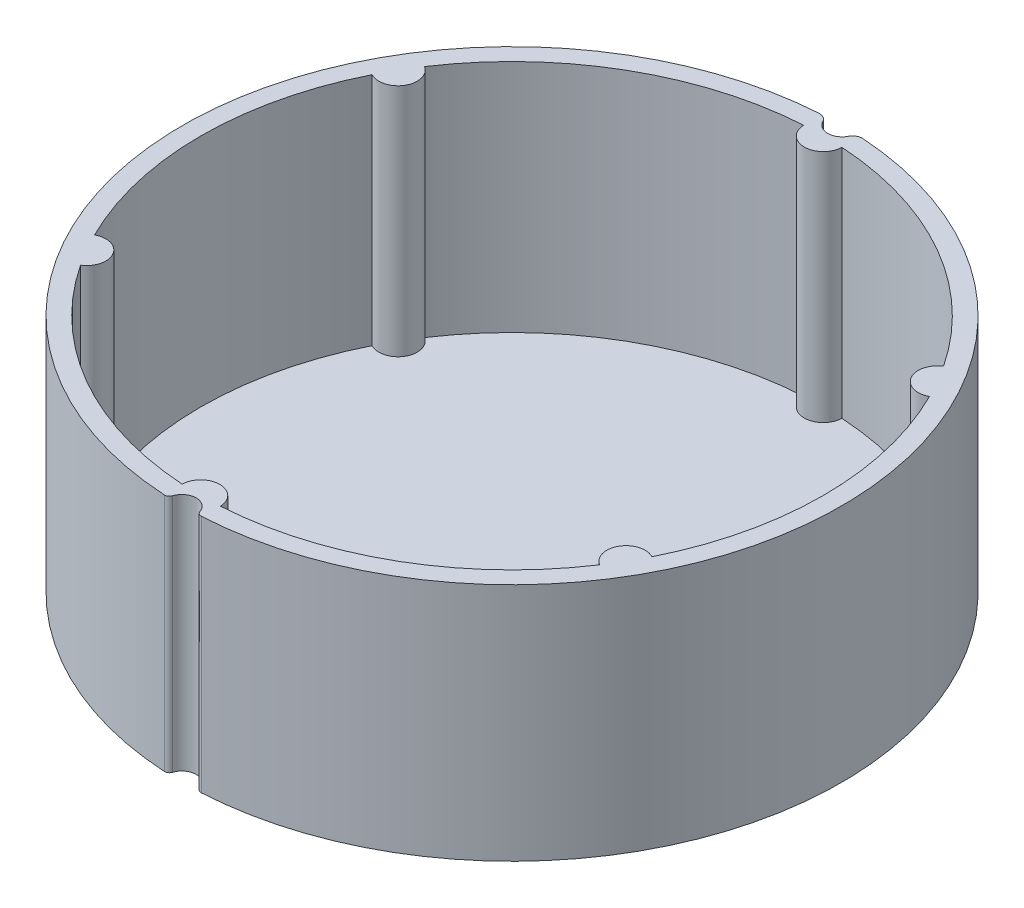
ISO-10303-21;
HEADER;
FILE_DESCRIPTION(('STEP AP214'),'2;1');
FILE_NAME('part.step','',(''),(''),'','','');
FILE_SCHEMA(('AUTOMOTIVE_DESIGN { 1 0 10303 214 1 1 1 1 }'));
ENDSEC;
DATA;
#1=APPLICATION_CONTEXT('core data for automotive mechanical design processes');
#2=APPLICATION_PROTOCOL_DEFINITION('international standard','automotive_design',2000,#1);
#3=PRODUCT_CONTEXT('',#1,'mechanical');
#4=PRODUCT('Part','Part','',(#3));
#5=PRODUCT_RELATED_PRODUCT_CATEGORY('part','',(#4));
#6=PRODUCT_DEFINITION_FORMATION('','',#4);
#7=PRODUCT_DEFINITION_CONTEXT('part definition',#1,'design');
#8=PRODUCT_DEFINITION('design','',#6,#7);
#9=PRODUCT_DEFINITION_SHAPE('','',#8);
#10=(LENGTH_UNIT() NAMED_UNIT(*) SI_UNIT(.MILLI.,.METRE.));
#11=(NAMED_UNIT(*) PLANE_ANGLE_UNIT() SI_UNIT($,.RADIAN.));
#12=(NAMED_UNIT(*) SI_UNIT($,.STERADIAN.) SOLID_ANGLE_UNIT());
#13=UNCERTAINTY_MEASURE_WITH_UNIT(LENGTH_MEASURE(1.E-05),#10,'distance_accuracy_value','');
#14=(GEOMETRIC_REPRESENTATION_CONTEXT(3) GLOBAL_UNCERTAINTY_ASSIGNED_CONTEXT((#13)) GLOBAL_UNIT_ASSIGNED_CONTEXT((#10,
#11,#12)) REPRESENTATION_CONTEXT('',''));
#15=CARTESIAN_POINT('',(0.,0.,0.));
#16=DIRECTION('',(0.,0.,1.));
#17=DIRECTION('',(1.,0.,0.));
#18=AXIS2_PLACEMENT_3D('',#15,#16,#17);
#19=CARTESIAN_POINT('',(-1.91626157924767,25.,33.8457965124164));
#20=DIRECTION('',(0.,-1.,0.));
#21=DIRECTION('',(0.,0.,-1.));
#22=AXIS2_PLACEMENT_3D('',#19,#20,#21);
#23=CYLINDRICAL_SURFACE('',#22,0.499999999999997);
#24=CARTESIAN_POINT('',(-1.91626157924767,0.,33.8457965124164));
#25=DIRECTION('',(0.,1.,0.));
#26=DIRECTION('',(0.,0.,1.));
#27=AXIS2_PLACEMENT_3D('',#24,#25,#26);
#28=CIRCLE('',#27,0.499999999999997);
#29=CARTESIAN_POINT('',(-1.43995370754552,0.,33.9978846820897));
#30=VERTEX_POINT('',#29);
#31=CARTESIAN_POINT('',(-1.94452502436932,0.,34.3449970509476));
#32=VERTEX_POINT('',#31);
#33=EDGE_CURVE('E252',#30,#32,#28,.F.);
#34=ORIENTED_EDGE('',*,*,#33,.F.);
#35=DIRECTION('',(0.,-1.,0.));
#36=VECTOR('',#35,1.);
#37=CARTESIAN_POINT('',(-1.43995370754552,25.,33.9978846820897));
#38=LINE('',#37,#36);
#39=CARTESIAN_POINT('',(-1.43995370754552,25.,33.9978846820897));
#40=VERTEX_POINT('',#39);
#41=EDGE_CURVE('E11',#40,#30,#38,.T.);
#42=ORIENTED_EDGE('',*,*,#41,.F.);
#43=CARTESIAN_POINT('',(-1.91626157924767,25.,33.8457965124164));
#44=DIRECTION('',(0.,1.,0.));
#45=DIRECTION('',(0.,0.,1.));
#46=AXIS2_PLACEMENT_3D('',#43,#44,#45);
#47=CIRCLE('',#46,0.499999999999997);
#48=CARTESIAN_POINT('',(-1.94452502436932,25.,34.3449970509476));
#49=VERTEX_POINT('',#48);
#50=EDGE_CURVE('E253',#40,#49,#47,.F.);
#51=ORIENTED_EDGE('',*,*,#50,.T.);
#52=DIRECTION('',(0.,-1.,0.));
#53=VECTOR('',#52,1.);
#54=CARTESIAN_POINT('',(-1.94452502436932,25.,34.3449970509476));
#55=LINE('',#54,#53);
#56=EDGE_CURVE('E274',#49,#32,#55,.T.);
#57=ORIENTED_EDGE('',*,*,#56,.T.);
#58=EDGE_LOOP('',(#34,#42,#51,#57));
#59=FACE_BOUND('',#58,.T.);
#60=ADVANCED_FACE('F37',(#59),#23,.T.);
#61=CARTESIAN_POINT('',(-0.0110300924390449,25.,34.4541491911095));
#62=DIRECTION('',(0.,-1.,0.));
#63=DIRECTION('',(0.,0.,-1.));
#64=AXIS2_PLACEMENT_3D('',#61,#62,#63);
#65=CYLINDRICAL_SURFACE('',#64,1.50000000000002);
#66=CARTESIAN_POINT('',(-0.0110300924390449,0.,34.4541491911095));
#67=DIRECTION('',(0.,1.,0.));
#68=DIRECTION('',(0.,0.,1.));
#69=AXIS2_PLACEMENT_3D('',#66,#67,#68);
#70=CIRCLE('',#69,1.50000000000002);
#71=CARTESIAN_POINT('',(1.41818536522127,0.,33.9987996818478));
#72=VERTEX_POINT('',#71);
#73=EDGE_CURVE('E277',#72,#30,#70,.T.);
#74=ORIENTED_EDGE('',*,*,#73,.F.);
#75=DIRECTION('',(0.,-1.,0.));
#76=VECTOR('',#75,1.);
#77=CARTESIAN_POINT('',(1.41818536522127,25.,33.9987996818478));
#78=LINE('',#77,#76);
#79=CARTESIAN_POINT('',(1.41818536522127,25.,33.9987996818478));
#80=VERTEX_POINT('',#79);
#81=EDGE_CURVE('E44',#80,#72,#78,.T.);
#82=ORIENTED_EDGE('',*,*,#81,.F.);
#83=CARTESIAN_POINT('',(-0.0110300924390449,25.,34.4541491911095));
#84=DIRECTION('',(0.,1.,0.));
#85=DIRECTION('',(0.,0.,1.));
#86=AXIS2_PLACEMENT_3D('',#83,#84,#85);
#87=CIRCLE('',#86,1.50000000000002);
#88=EDGE_CURVE('E256',#80,#40,#87,.T.);
#89=ORIENTED_EDGE('',*,*,#88,.T.);
#90=ORIENTED_EDGE('',*,*,#41,.T.);
#91=EDGE_LOOP('',(#74,#82,#89,#90));
#92=FACE_BOUND('',#91,.T.);
#93=ADVANCED_FACE('F318',(#92),#65,.F.);
#94=CARTESIAN_POINT('',(1.8945905177747,25.,33.8470165120939));
#95=DIRECTION('',(0.,-1.,0.));
#96=DIRECTION('',(0.,0.,-1.));
#97=AXIS2_PLACEMENT_3D('',#94,#95,#96);
#98=CYLINDRICAL_SURFACE('',#97,0.499999999999999);
#99=CARTESIAN_POINT('',(1.8945905177747,0.,33.8470165120939));
#100=DIRECTION('',(0.,1.,0.));
#101=DIRECTION('',(0.,0.,1.));
#102=AXIS2_PLACEMENT_3D('',#99,#100,#101);
#103=CIRCLE('',#102,0.499999999999999);
#104=CARTESIAN_POINT('',(1.92253433072123,0.,34.3462350447207));
#105=VERTEX_POINT('',#104);
#106=EDGE_CURVE('E280',#72,#105,#103,.T.);
#107=ORIENTED_EDGE('',*,*,#106,.T.);
#108=DIRECTION('',(0.,-1.,0.));
#109=VECTOR('',#108,1.);
#110=CARTESIAN_POINT('',(1.92253433072123,25.,34.3462350447207));
#111=LINE('',#110,#109);
#112=CARTESIAN_POINT('',(1.92253433072123,25.,34.3462350447207));
#113=VERTEX_POINT('',#112);
#114=EDGE_CURVE('E305',#113,#105,#111,.T.);
#115=ORIENTED_EDGE('',*,*,#114,.F.);
#116=CARTESIAN_POINT('',(1.8945905177747,25.,33.8470165120939));
#117=DIRECTION('',(0.,1.,0.));
#118=DIRECTION('',(0.,0.,1.));
#119=AXIS2_PLACEMENT_3D('',#116,#117,#118);
#120=CIRCLE('',#119,0.499999999999999);
#121=EDGE_CURVE('E260',#80,#113,#120,.T.);
#122=ORIENTED_EDGE('',*,*,#121,.F.);
#123=ORIENTED_EDGE('',*,*,#81,.T.);
#124=EDGE_LOOP('',(#107,#115,#122,#123));
#125=FACE_BOUND('',#124,.T.);
#126=ADVANCED_FACE('F310',(#125),#98,.T.);
#127=CARTESIAN_POINT('',(0.,25.,0.));
#128=DIRECTION('',(0.,-1.,0.));
#129=DIRECTION('',(0.,0.,-1.));
#130=AXIS2_PLACEMENT_3D('',#127,#128,#129);
#131=CYLINDRICAL_SURFACE('',#130,34.4);
#132=CARTESIAN_POINT('',(0.,0.,0.));
#133=DIRECTION('',(0.,1.,0.));
#134=DIRECTION('',(0.,0.,1.));
#135=AXIS2_PLACEMENT_3D('',#132,#133,#134);
#136=CIRCLE('',#135,34.4);
#137=CARTESIAN_POINT('',(2.29747762435663,0.,-34.3231932746005));
#138=VERTEX_POINT('',#137);
#139=EDGE_CURVE('E282',#105,#138,#136,.T.);
#140=ORIENTED_EDGE('',*,*,#139,.T.);
#141=DIRECTION('',(0.,-1.,0.));
#142=VECTOR('',#141,1.);
#143=CARTESIAN_POINT('',(2.29747762435663,25.,-34.3231932746005));
#144=LINE('',#143,#142);
#145=CARTESIAN_POINT('',(2.29747762435663,25.,-34.3231932746005));
#146=VERTEX_POINT('',#145);
#147=EDGE_CURVE('E303',#146,#138,#144,.T.);
#148=ORIENTED_EDGE('',*,*,#147,.F.);
#149=CARTESIAN_POINT('',(0.,25.,0.));
#150=DIRECTION('',(0.,1.,0.));
#151=DIRECTION('',(0.,0.,1.));
#152=AXIS2_PLACEMENT_3D('',#149,#150,#151);
#153=CIRCLE('',#152,34.4);
#154=EDGE_CURVE('E262',#113,#146,#153,.T.);
#155=ORIENTED_EDGE('',*,*,#154,.F.);
#156=ORIENTED_EDGE('',*,*,#114,.T.);
#157=EDGE_LOOP('',(#140,#148,#155,#156));
#158=FACE_BOUND('',#157,.T.);
#159=ADVANCED_FACE('F343',(#158),#131,.T.);
#160=CARTESIAN_POINT('',(2.23069048411371,25.,-33.3254260282458));
#161=DIRECTION('',(0.,-1.,0.));
#162=DIRECTION('',(0.,0.,-1.));
#163=AXIS2_PLACEMENT_3D('',#160,#161,#162);
#164=CYLINDRICAL_SURFACE('',#163,1.);
#165=CARTESIAN_POINT('',(2.23069048411371,0.,-33.3254260282458));
#166=DIRECTION('',(0.,1.,0.));
#167=DIRECTION('',(0.,0.,1.));
#168=AXIS2_PLACEMENT_3D('',#165,#166,#167);
#169=CIRCLE('',#168,1.);
#170=CARTESIAN_POINT('',(1.33841429046819,0.,-33.7769159996222));
#171=VERTEX_POINT('',#170);
#172=EDGE_CURVE('E285',#171,#138,#169,.F.);
#173=ORIENTED_EDGE('',*,*,#172,.F.);
#174=DIRECTION('',(0.,-1.,0.));
#175=VECTOR('',#174,1.);
#176=CARTESIAN_POINT('',(1.33841429046819,25.,-33.7769159996222));
#177=LINE('',#176,#175);
#178=CARTESIAN_POINT('',(1.33841429046819,25.,-33.7769159996222));
#179=VERTEX_POINT('',#178);
#180=EDGE_CURVE('E301',#179,#171,#177,.T.);
#181=ORIENTED_EDGE('',*,*,#180,.F.);
#182=CARTESIAN_POINT('',(2.23069048411371,25.,-33.3254260282458));
#183=DIRECTION('',(0.,1.,0.));
#184=DIRECTION('',(0.,0.,1.));
#185=AXIS2_PLACEMENT_3D('',#182,#183,#184);
#186=CIRCLE('',#185,1.);
#187=EDGE_CURVE('E264',#179,#146,#186,.F.);
#188=ORIENTED_EDGE('',*,*,#187,.T.);
#189=ORIENTED_EDGE('',*,*,#147,.T.);
#190=EDGE_LOOP('',(#173,#181,#188,#189));
#191=FACE_BOUND('',#190,.T.);
#192=ADVANCED_FACE('F338',(#191),#164,.T.);
#193=CARTESIAN_POINT('',(0.,25.,-34.4541509566868));
#194=DIRECTION('',(0.,-1.,0.));
#195=DIRECTION('',(0.,0.,-1.));
#196=AXIS2_PLACEMENT_3D('',#193,#194,#195);
#197=CYLINDRICAL_SURFACE('',#196,1.49999999999991);
#198=CARTESIAN_POINT('',(0.,0.,-34.4541509566868));
#199=DIRECTION('',(0.,1.,0.));
#200=DIRECTION('',(0.,0.,1.));
#201=AXIS2_PLACEMENT_3D('',#198,#199,#200);
#202=CIRCLE('',#201,1.49999999999991);
#203=CARTESIAN_POINT('',(-1.33841429046819,0.,-33.7769159996222));
#204=VERTEX_POINT('',#203);
#205=EDGE_CURVE('E288',#204,#171,#202,.T.);
#206=ORIENTED_EDGE('',*,*,#205,.F.);
#207=DIRECTION('',(0.,-1.,0.));
#208=VECTOR('',#207,1.);
#209=CARTESIAN_POINT('',(-1.33841429046819,25.,-33.7769159996222));
#210=LINE('',#209,#208);
#211=CARTESIAN_POINT('',(-1.33841429046819,25.,-33.7769159996222));
#212=VERTEX_POINT('',#211);
#213=EDGE_CURVE('E299',#212,#204,#210,.T.);
#214=ORIENTED_EDGE('',*,*,#213,.F.);
#215=CARTESIAN_POINT('',(0.,25.,-34.4541509566868));
#216=DIRECTION('',(0.,1.,0.));
#217=DIRECTION('',(0.,0.,1.));
#218=AXIS2_PLACEMENT_3D('',#215,#216,#217);
#219=CIRCLE('',#218,1.49999999999991);
#220=EDGE_CURVE('E267',#212,#179,#219,.T.);
#221=ORIENTED_EDGE('',*,*,#220,.T.);
#222=ORIENTED_EDGE('',*,*,#180,.T.);
#223=EDGE_LOOP('',(#206,#214,#221,#222));
#224=FACE_BOUND('',#223,.T.);
#225=ADVANCED_FACE('F335',(#224),#197,.F.);
#226=CARTESIAN_POINT('',(-2.23069048411371,25.,-33.3254260282458));
#227=DIRECTION('',(0.,-1.,0.));
#228=DIRECTION('',(0.,0.,-1.));
#229=AXIS2_PLACEMENT_3D('',#226,#227,#228);
#230=CYLINDRICAL_SURFACE('',#229,1.);
#231=CARTESIAN_POINT('',(-2.23069048411371,0.,-33.3254260282458));
#232=DIRECTION('',(0.,1.,0.));
#233=DIRECTION('',(0.,0.,1.));
#234=AXIS2_PLACEMENT_3D('',#231,#232,#233);
#235=CIRCLE('',#234,1.);
#236=CARTESIAN_POINT('',(-2.29747762435663,0.,-34.3231932746005));
#237=VERTEX_POINT('',#236);
#238=EDGE_CURVE('E291',#204,#237,#235,.T.);
#239=ORIENTED_EDGE('',*,*,#238,.T.);
#240=DIRECTION('',(0.,-1.,0.));
#241=VECTOR('',#240,1.);
#242=CARTESIAN_POINT('',(-2.29747762435663,25.,-34.3231932746005));
#243=LINE('',#242,#241);
#244=CARTESIAN_POINT('',(-2.29747762435663,25.,-34.3231932746005));
#245=VERTEX_POINT('',#244);
#246=EDGE_CURVE('E296',#245,#237,#243,.T.);
#247=ORIENTED_EDGE('',*,*,#246,.F.);
#248=CARTESIAN_POINT('',(-2.23069048411371,25.,-33.3254260282458));
#249=DIRECTION('',(0.,1.,0.));
#250=DIRECTION('',(0.,0.,1.));
#251=AXIS2_PLACEMENT_3D('',#248,#249,#250);
#252=CIRCLE('',#251,1.);
#253=EDGE_CURVE('E270',#212,#245,#252,.T.);
#254=ORIENTED_EDGE('',*,*,#253,.F.);
#255=ORIENTED_EDGE('',*,*,#213,.T.);
#256=EDGE_LOOP('',(#239,#247,#254,#255));
#257=FACE_BOUND('',#256,.T.);
#258=ADVANCED_FACE('F332',(#257),#230,.T.);
#259=CARTESIAN_POINT('',(0.,25.,0.));
#260=DIRECTION('',(0.,-1.,0.));
#261=DIRECTION('',(0.,0.,-1.));
#262=AXIS2_PLACEMENT_3D('',#259,#260,#261);
#263=CYLINDRICAL_SURFACE('',#262,34.4);
#264=CARTESIAN_POINT('',(0.,0.,0.));
#265=DIRECTION('',(0.,1.,0.));
#266=DIRECTION('',(0.,0.,1.));
#267=AXIS2_PLACEMENT_3D('',#264,#265,#266);
#268=CIRCLE('',#267,34.4);
#269=EDGE_CURVE('E257',#237,#32,#268,.T.);
#270=ORIENTED_EDGE('',*,*,#269,.T.);
#271=ORIENTED_EDGE('',*,*,#56,.F.);
#272=CARTESIAN_POINT('',(0.,25.,0.));
#273=DIRECTION('',(0.,1.,0.));
#274=DIRECTION('',(0.,0.,1.));
#275=AXIS2_PLACEMENT_3D('',#272,#273,#274);
#276=CIRCLE('',#275,34.4);
#277=EDGE_CURVE('E272',#245,#49,#276,.T.);
#278=ORIENTED_EDGE('',*,*,#277,.F.);
#279=ORIENTED_EDGE('',*,*,#246,.T.);
#280=EDGE_LOOP('',(#270,#271,#278,#279));
#281=FACE_BOUND('',#280,.T.);
#282=ADVANCED_FACE('F327',(#281),#263,.T.);
#283=CARTESIAN_POINT('',(0.,25.,0.));
#284=DIRECTION('',(0.,1.,0.));
#285=DIRECTION('',(0.,0.,1.));
#286=AXIS2_PLACEMENT_3D('',#283,#284,#285);
#287=PLANE('',#286);
#288=CARTESIAN_POINT('',(0.,25.,0.));
#289=DIRECTION('',(0.,1.,0.));
#290=DIRECTION('',(0.,0.,1.));
#291=AXIS2_PLACEMENT_3D('',#288,#289,#290);
#292=CIRCLE('',#291,32.5);
#293=CARTESIAN_POINT('',(-29.092058267117,25.,-14.4880000615224));
#294=VERTEX_POINT('',#293);
#295=CARTESIAN_POINT('',(-29.0920582671172,25.,14.4880000615221));
#296=VERTEX_POINT('',#295);
#297=EDGE_CURVE('E198',#294,#296,#292,.T.);
#298=ORIENTED_EDGE('',*,*,#297,.F.);
#299=CARTESIAN_POINT('',(-28.1458256229941,25.,-16.2500000000003));
#300=DIRECTION('',(0.,1.,0.));
#301=DIRECTION('',(0.,0.,1.));
#302=AXIS2_PLACEMENT_3D('',#299,#300,#301);
#303=CIRCLE('',#302,2.);
#304=CARTESIAN_POINT('',(-27.093005236867,25.,-17.9504614769398));
#305=VERTEX_POINT('',#304);
#306=EDGE_CURVE('E196',#305,#294,#303,.F.);
#307=ORIENTED_EDGE('',*,*,#306,.F.);
#308=CARTESIAN_POINT('',(0.,25.,0.));
#309=DIRECTION('',(0.,1.,0.));
#310=DIRECTION('',(0.,0.,1.));
#311=AXIS2_PLACEMENT_3D('',#308,#309,#310);
#312=CIRCLE('',#311,32.5);
#313=CARTESIAN_POINT('',(-1.99905303024994,25.,-32.4384615384615));
#314=VERTEX_POINT('',#313);
#315=EDGE_CURVE('E181',#314,#305,#312,.T.);
#316=ORIENTED_EDGE('',*,*,#315,.F.);
#317=CARTESIAN_POINT('',(0.,25.,-32.5));
#318=DIRECTION('',(0.,1.,0.));
#319=DIRECTION('',(0.,0.,1.));
#320=AXIS2_PLACEMENT_3D('',#317,#318,#319);
#321=CIRCLE('',#320,2.);
#322=CARTESIAN_POINT('',(1.99905303024994,25.,-32.4384615384615));
#323=VERTEX_POINT('',#322);
#324=EDGE_CURVE('E221',#323,#314,#321,.F.);
#325=ORIENTED_EDGE('',*,*,#324,.F.);
#326=CARTESIAN_POINT('',(0.,25.,0.));
#327=DIRECTION('',(0.,1.,0.));
#328=DIRECTION('',(0.,0.,1.));
#329=AXIS2_PLACEMENT_3D('',#326,#327,#328);
#330=CIRCLE('',#329,32.5);
#331=CARTESIAN_POINT('',(27.0930052368672,25.,-17.9504614769394));
#332=VERTEX_POINT('',#331);
#333=EDGE_CURVE('E219',#332,#323,#330,.T.);
#334=ORIENTED_EDGE('',*,*,#333,.F.);
#335=CARTESIAN_POINT('',(28.1458256229943,25.,-16.2499999999999));
#336=DIRECTION('',(0.,1.,0.));
#337=DIRECTION('',(0.,0.,1.));
#338=AXIS2_PLACEMENT_3D('',#335,#336,#337);
#339=CIRCLE('',#338,2.);
#340=CARTESIAN_POINT('',(29.0920582671171,25.,-14.488000061522));
#341=VERTEX_POINT('',#340);
#342=EDGE_CURVE('E217',#341,#332,#339,.F.);
#343=ORIENTED_EDGE('',*,*,#342,.F.);
#344=CARTESIAN_POINT('',(0.,25.,0.));
#345=DIRECTION('',(0.,1.,0.));
#346=DIRECTION('',(0.,0.,1.));
#347=AXIS2_PLACEMENT_3D('',#344,#345,#346);
#348=CIRCLE('',#347,32.5);
#349=CARTESIAN_POINT('',(29.0920582671172,25.,14.4880000615221));
#350=VERTEX_POINT('',#349);
#351=EDGE_CURVE('E215',#350,#341,#348,.T.);
#352=ORIENTED_EDGE('',*,*,#351,.F.);
#353=CARTESIAN_POINT('',(28.1458256229943,25.,16.25));
#354=DIRECTION('',(0.,1.,0.));
#355=DIRECTION('',(0.,0.,1.));
#356=AXIS2_PLACEMENT_3D('',#353,#354,#355);
#357=CIRCLE('',#356,2.);
#358=CARTESIAN_POINT('',(27.0930052368672,25.,17.9504614769395));
#359=VERTEX_POINT('',#358);
#360=EDGE_CURVE('E213',#359,#350,#357,.F.);
#361=ORIENTED_EDGE('',*,*,#360,.F.);
#362=CARTESIAN_POINT('',(0.,25.,0.));
#363=DIRECTION('',(0.,1.,0.));
#364=DIRECTION('',(0.,0.,1.));
#365=AXIS2_PLACEMENT_3D('',#362,#363,#364);
#366=CIRCLE('',#365,32.5);
#367=CARTESIAN_POINT('',(1.99905303024972,25.,32.4384615384617));
#368=VERTEX_POINT('',#367);
#369=EDGE_CURVE('E211',#368,#359,#366,.T.);
#370=ORIENTED_EDGE('',*,*,#369,.F.);
#371=CARTESIAN_POINT('',(-2.26946287024804E-13,25.,32.5));
#372=DIRECTION('',(0.,1.,0.));
#373=DIRECTION('',(0.,0.,1.));
#374=AXIS2_PLACEMENT_3D('',#371,#372,#373);
#375=CIRCLE('',#374,2.);
#376=CARTESIAN_POINT('',(-1.99905303025017,25.,32.4384615384617));
#377=VERTEX_POINT('',#376);
#378=EDGE_CURVE('E209',#377,#368,#375,.F.);
#379=ORIENTED_EDGE('',*,*,#378,.F.);
#380=CARTESIAN_POINT('',(0.,25.,0.));
#381=DIRECTION('',(0.,1.,0.));
#382=DIRECTION('',(0.,0.,1.));
#383=AXIS2_PLACEMENT_3D('',#380,#381,#382);
#384=CIRCLE('',#383,32.5000000000001);
#385=CARTESIAN_POINT('',(-27.0930052368673,25.,17.9504614769396));
#386=VERTEX_POINT('',#385);
#387=EDGE_CURVE('E207',#386,#377,#384,.T.);
#388=ORIENTED_EDGE('',*,*,#387,.F.);
#389=CARTESIAN_POINT('',(-28.1458256229942,25.,16.25));
#390=DIRECTION('',(0.,1.,0.));
#391=DIRECTION('',(0.,0.,1.));
#392=AXIS2_PLACEMENT_3D('',#389,#390,#391);
#393=CIRCLE('',#392,2.);
#394=EDGE_CURVE('E205',#296,#386,#393,.F.);
#395=ORIENTED_EDGE('',*,*,#394,.F.);
#396=EDGE_LOOP('',(#298,#307,#316,#325,#334,#343,#352,#361,#370,#379,#388,#395));
#397=FACE_BOUND('',#396,.T.);
#398=ORIENTED_EDGE('',*,*,#50,.F.);
#399=ORIENTED_EDGE('',*,*,#88,.F.);
#400=ORIENTED_EDGE('',*,*,#121,.T.);
#401=ORIENTED_EDGE('',*,*,#154,.T.);
#402=ORIENTED_EDGE('',*,*,#187,.F.);
#403=ORIENTED_EDGE('',*,*,#220,.F.);
#404=ORIENTED_EDGE('',*,*,#253,.T.);
#405=ORIENTED_EDGE('',*,*,#277,.T.);
#406=EDGE_LOOP('',(#398,#399,#400,#401,#402,#403,#404,#405));
#407=FACE_BOUND('',#406,.T.);
#408=ADVANCED_FACE('F345',(#397,#407),#287,.T.);
#409=CARTESIAN_POINT('',(0.,0.,0.));
#410=DIRECTION('',(0.,1.,0.));
#411=DIRECTION('',(0.,0.,1.));
#412=AXIS2_PLACEMENT_3D('',#409,#410,#411);
#413=PLANE('',#412);
#414=ORIENTED_EDGE('',*,*,#33,.T.);
#415=ORIENTED_EDGE('',*,*,#269,.F.);
#416=ORIENTED_EDGE('',*,*,#238,.F.);
#417=ORIENTED_EDGE('',*,*,#205,.T.);
#418=ORIENTED_EDGE('',*,*,#172,.T.);
#419=ORIENTED_EDGE('',*,*,#139,.F.);
#420=ORIENTED_EDGE('',*,*,#106,.F.);
#421=ORIENTED_EDGE('',*,*,#73,.T.);
#422=EDGE_LOOP('',(#414,#415,#416,#417,#418,#419,#420,#421));
#423=FACE_BOUND('',#422,.T.);
#424=ADVANCED_FACE('F317',(#423),#413,.F.);
#425=CARTESIAN_POINT('',(-28.1458256229941,25.,-16.2500000000003));
#426=DIRECTION('',(0.,-1.,0.));
#427=DIRECTION('',(0.,0.,-1.));
#428=AXIS2_PLACEMENT_3D('',#425,#426,#427);
#429=CYLINDRICAL_SURFACE('',#428,2.);
#430=CARTESIAN_POINT('',(-28.1458256229941,0.5,-16.2500000000003));
#431=DIRECTION('',(0.,1.,0.));
#432=DIRECTION('',(0.,0.,1.));
#433=AXIS2_PLACEMENT_3D('',#430,#431,#432);
#434=CIRCLE('',#433,2.);
#435=CARTESIAN_POINT('',(-27.093005236867,0.5,-17.9504614769398));
#436=VERTEX_POINT('',#435);
#437=CARTESIAN_POINT('',(-29.092058267117,0.5,-14.4880000615224));
#438=VERTEX_POINT('',#437);
#439=EDGE_CURVE('E187',#436,#438,#434,.F.);
#440=ORIENTED_EDGE('',*,*,#439,.F.);
#441=DIRECTION('',(0.,-1.,0.));
#442=VECTOR('',#441,1.);
#443=CARTESIAN_POINT('',(-27.093005236867,25.,-17.9504614769398));
#444=LINE('',#443,#442);
#445=EDGE_CURVE('E174',#305,#436,#444,.T.);
#446=ORIENTED_EDGE('',*,*,#445,.F.);
#447=ORIENTED_EDGE('',*,*,#306,.T.);
#448=DIRECTION('',(0.,-1.,0.));
#449=VECTOR('',#448,1.);
#450=CARTESIAN_POINT('',(-29.092058267117,25.,-14.4880000615224));
#451=LINE('',#450,#449);
#452=EDGE_CURVE('E189',#294,#438,#451,.T.);
#453=ORIENTED_EDGE('',*,*,#452,.T.);
#454=EDGE_LOOP('',(#440,#446,#447,#453));
#455=FACE_BOUND('',#454,.T.);
#456=ADVANCED_FACE('F188',(#455),#429,.T.);
#457=CARTESIAN_POINT('',(0.,25.,0.));
#458=DIRECTION('',(0.,-1.,0.));
#459=DIRECTION('',(0.,0.,-1.));
#460=AXIS2_PLACEMENT_3D('',#457,#458,#459);
#461=CYLINDRICAL_SURFACE('',#460,32.5);
#462=CARTESIAN_POINT('',(0.,0.5,0.));
#463=DIRECTION('',(0.,1.,0.));
#464=DIRECTION('',(0.,0.,1.));
#465=AXIS2_PLACEMENT_3D('',#462,#463,#464);
#466=CIRCLE('',#465,32.5);
#467=CARTESIAN_POINT('',(-29.0920582671172,0.5,14.4880000615221));
#468=VERTEX_POINT('',#467);
#469=EDGE_CURVE('E51',#438,#468,#466,.T.);
#470=ORIENTED_EDGE('',*,*,#469,.F.);
#471=ORIENTED_EDGE('',*,*,#452,.F.);
#472=ORIENTED_EDGE('',*,*,#297,.T.);
#473=DIRECTION('',(0.,-1.,0.));
#474=VECTOR('',#473,1.);
#475=CARTESIAN_POINT('',(-29.0920582671172,25.,14.4880000615221));
#476=LINE('',#475,#474);
#477=EDGE_CURVE('E249',#296,#468,#476,.T.);
#478=ORIENTED_EDGE('',*,*,#477,.T.);
#479=EDGE_LOOP('',(#470,#471,#472,#478));
#480=FACE_BOUND('',#479,.T.);
#481=ADVANCED_FACE('F403',(#480),#461,.F.);
#482=CARTESIAN_POINT('',(-28.1458256229942,25.,16.25));
#483=DIRECTION('',(0.,-1.,0.));
#484=DIRECTION('',(0.,0.,-1.));
#485=AXIS2_PLACEMENT_3D('',#482,#483,#484);
#486=CYLINDRICAL_SURFACE('',#485,2.);
#487=CARTESIAN_POINT('',(-28.1458256229942,0.5,16.25));
#488=DIRECTION('',(0.,1.,0.));
#489=DIRECTION('',(0.,0.,1.));
#490=AXIS2_PLACEMENT_3D('',#487,#488,#489);
#491=CIRCLE('',#490,2.);
#492=CARTESIAN_POINT('',(-27.0930052368673,0.5,17.9504614769396));
#493=VERTEX_POINT('',#492);
#494=EDGE_CURVE('E59',#468,#493,#491,.F.);
#495=ORIENTED_EDGE('',*,*,#494,.F.);
#496=ORIENTED_EDGE('',*,*,#477,.F.);
#497=ORIENTED_EDGE('',*,*,#394,.T.);
#498=DIRECTION('',(0.,-1.,0.));
#499=VECTOR('',#498,1.);
#500=CARTESIAN_POINT('',(-27.0930052368673,25.,17.9504614769396));
#501=LINE('',#500,#499);
#502=EDGE_CURVE('E247',#386,#493,#501,.T.);
#503=ORIENTED_EDGE('',*,*,#502,.T.);
#504=EDGE_LOOP('',(#495,#496,#497,#503));
#505=FACE_BOUND('',#504,.T.);
#506=ADVANCED_FACE('F411',(#505),#486,.T.);
#507=CARTESIAN_POINT('',(0.,25.,0.));
#508=DIRECTION('',(0.,-1.,0.));
#509=DIRECTION('',(0.,0.,-1.));
#510=AXIS2_PLACEMENT_3D('',#507,#508,#509);
#511=CYLINDRICAL_SURFACE('',#510,32.5000000000001);
#512=CARTESIAN_POINT('',(0.,0.5,0.));
#513=DIRECTION('',(0.,1.,0.));
#514=DIRECTION('',(0.,0.,1.));
#515=AXIS2_PLACEMENT_3D('',#512,#513,#514);
#516=CIRCLE('',#515,32.5000000000001);
#517=CARTESIAN_POINT('',(-1.99905303025017,0.5,32.4384615384617));
#518=VERTEX_POINT('',#517);
#519=EDGE_CURVE('E537',#493,#518,#516,.T.);
#520=ORIENTED_EDGE('',*,*,#519,.F.);
#521=ORIENTED_EDGE('',*,*,#502,.F.);
#522=ORIENTED_EDGE('',*,*,#387,.T.);
#523=DIRECTION('',(0.,-1.,0.));
#524=VECTOR('',#523,1.);
#525=CARTESIAN_POINT('',(-1.99905303025017,25.,32.4384615384617));
#526=LINE('',#525,#524);
#527=EDGE_CURVE('E244',#377,#518,#526,.T.);
#528=ORIENTED_EDGE('',*,*,#527,.T.);
#529=EDGE_LOOP('',(#520,#521,#522,#528));
#530=FACE_BOUND('',#529,.T.);
#531=ADVANCED_FACE('F420',(#530),#511,.F.);
#532=CARTESIAN_POINT('',(-2.26946287024804E-13,25.,32.5));
#533=DIRECTION('',(0.,-1.,0.));
#534=DIRECTION('',(0.,0.,-1.));
#535=AXIS2_PLACEMENT_3D('',#532,#533,#534);
#536=CYLINDRICAL_SURFACE('',#535,2.);
#537=CARTESIAN_POINT('',(-2.26946287024804E-13,0.5,32.5));
#538=DIRECTION('',(0.,1.,0.));
#539=DIRECTION('',(0.,0.,1.));
#540=AXIS2_PLACEMENT_3D('',#537,#538,#539);
#541=CIRCLE('',#540,2.);
#542=CARTESIAN_POINT('',(1.99905303024972,0.5,32.4384615384617));
#543=VERTEX_POINT('',#542);
#544=EDGE_CURVE('E534',#518,#543,#541,.F.);
#545=ORIENTED_EDGE('',*,*,#544,.F.);
#546=ORIENTED_EDGE('',*,*,#527,.F.);
#547=ORIENTED_EDGE('',*,*,#378,.T.);
#548=DIRECTION('',(0.,-1.,0.));
#549=VECTOR('',#548,1.);
#550=CARTESIAN_POINT('',(1.99905303024972,25.,32.4384615384617));
#551=LINE('',#550,#549);
#552=EDGE_CURVE('E241',#368,#543,#551,.T.);
#553=ORIENTED_EDGE('',*,*,#552,.T.);
#554=EDGE_LOOP('',(#545,#546,#547,#553));
#555=FACE_BOUND('',#554,.T.);
#556=ADVANCED_FACE('F429',(#555),#536,.T.);
#557=CARTESIAN_POINT('',(0.,25.,0.));
#558=DIRECTION('',(0.,-1.,0.));
#559=DIRECTION('',(0.,0.,-1.));
#560=AXIS2_PLACEMENT_3D('',#557,#558,#559);
#561=CYLINDRICAL_SURFACE('',#560,32.5);
#562=CARTESIAN_POINT('',(0.,0.5,0.));
#563=DIRECTION('',(0.,1.,0.));
#564=DIRECTION('',(0.,0.,1.));
#565=AXIS2_PLACEMENT_3D('',#562,#563,#564);
#566=CIRCLE('',#565,32.5);
#567=CARTESIAN_POINT('',(27.0930052368672,0.5,17.9504614769395));
#568=VERTEX_POINT('',#567);
#569=EDGE_CURVE('E531',#543,#568,#566,.T.);
#570=ORIENTED_EDGE('',*,*,#569,.F.);
#571=ORIENTED_EDGE('',*,*,#552,.F.);
#572=ORIENTED_EDGE('',*,*,#369,.T.);
#573=DIRECTION('',(0.,-1.,0.));
#574=VECTOR('',#573,1.);
#575=CARTESIAN_POINT('',(27.0930052368672,25.,17.9504614769395));
#576=LINE('',#575,#574);
#577=EDGE_CURVE('E238',#359,#568,#576,.T.);
#578=ORIENTED_EDGE('',*,*,#577,.T.);
#579=EDGE_LOOP('',(#570,#571,#572,#578));
#580=FACE_BOUND('',#579,.T.);
#581=ADVANCED_FACE('F439',(#580),#561,.F.);
#582=CARTESIAN_POINT('',(28.1458256229943,25.,16.25));
#583=DIRECTION('',(0.,-1.,0.));
#584=DIRECTION('',(0.,0.,-1.));
#585=AXIS2_PLACEMENT_3D('',#582,#583,#584);
#586=CYLINDRICAL_SURFACE('',#585,2.);
#587=CARTESIAN_POINT('',(28.1458256229943,0.5,16.25));
#588=DIRECTION('',(0.,1.,0.));
#589=DIRECTION('',(0.,0.,1.));
#590=AXIS2_PLACEMENT_3D('',#587,#588,#589);
#591=CIRCLE('',#590,2.);
#592=CARTESIAN_POINT('',(29.0920582671172,0.5,14.4880000615221));
#593=VERTEX_POINT('',#592);
#594=EDGE_CURVE('E528',#568,#593,#591,.F.);
#595=ORIENTED_EDGE('',*,*,#594,.F.);
#596=ORIENTED_EDGE('',*,*,#577,.F.);
#597=ORIENTED_EDGE('',*,*,#360,.T.);
#598=DIRECTION('',(0.,-1.,0.));
#599=VECTOR('',#598,1.);
#600=CARTESIAN_POINT('',(29.0920582671172,25.,14.4880000615221));
#601=LINE('',#600,#599);
#602=EDGE_CURVE('E235',#350,#593,#601,.T.);
#603=ORIENTED_EDGE('',*,*,#602,.T.);
#604=EDGE_LOOP('',(#595,#596,#597,#603));
#605=FACE_BOUND('',#604,.T.);
#606=ADVANCED_FACE('F449',(#605),#586,.T.);
#607=CARTESIAN_POINT('',(0.,25.,0.));
#608=DIRECTION('',(0.,-1.,0.));
#609=DIRECTION('',(0.,0.,-1.));
#610=AXIS2_PLACEMENT_3D('',#607,#608,#609);
#611=CYLINDRICAL_SURFACE('',#610,32.5);
#612=CARTESIAN_POINT('',(0.,0.5,0.));
#613=DIRECTION('',(0.,1.,0.));
#614=DIRECTION('',(0.,0.,1.));
#615=AXIS2_PLACEMENT_3D('',#612,#613,#614);
#616=CIRCLE('',#615,32.5);
#617=CARTESIAN_POINT('',(29.0920582671171,0.5,-14.488000061522));
#618=VERTEX_POINT('',#617);
#619=EDGE_CURVE('E524',#593,#618,#616,.T.);
#620=ORIENTED_EDGE('',*,*,#619,.F.);
#621=ORIENTED_EDGE('',*,*,#602,.F.);
#622=ORIENTED_EDGE('',*,*,#351,.T.);
#623=DIRECTION('',(0.,-1.,0.));
#624=VECTOR('',#623,1.);
#625=CARTESIAN_POINT('',(29.0920582671171,25.,-14.488000061522));
#626=LINE('',#625,#624);
#627=EDGE_CURVE('E232',#341,#618,#626,.T.);
#628=ORIENTED_EDGE('',*,*,#627,.T.);
#629=EDGE_LOOP('',(#620,#621,#622,#628));
#630=FACE_BOUND('',#629,.T.);
#631=ADVANCED_FACE('F459',(#630),#611,.F.);
#632=CARTESIAN_POINT('',(28.1458256229943,25.,-16.2499999999999));
#633=DIRECTION('',(0.,-1.,0.));
#634=DIRECTION('',(0.,0.,-1.));
#635=AXIS2_PLACEMENT_3D('',#632,#633,#634);
#636=CYLINDRICAL_SURFACE('',#635,2.);
#637=CARTESIAN_POINT('',(28.1458256229943,0.5,-16.2499999999999));
#638=DIRECTION('',(0.,1.,0.));
#639=DIRECTION('',(0.,0.,1.));
#640=AXIS2_PLACEMENT_3D('',#637,#638,#639);
#641=CIRCLE('',#640,2.);
#642=CARTESIAN_POINT('',(27.0930052368672,0.5,-17.9504614769394));
#643=VERTEX_POINT('',#642);
#644=EDGE_CURVE('E523',#618,#643,#641,.F.);
#645=ORIENTED_EDGE('',*,*,#644,.F.);
#646=ORIENTED_EDGE('',*,*,#627,.F.);
#647=ORIENTED_EDGE('',*,*,#342,.T.);
#648=DIRECTION('',(0.,-1.,0.));
#649=VECTOR('',#648,1.);
#650=CARTESIAN_POINT('',(27.0930052368672,25.,-17.9504614769394));
#651=LINE('',#650,#649);
#652=EDGE_CURVE('E229',#332,#643,#651,.T.);
#653=ORIENTED_EDGE('',*,*,#652,.T.);
#654=EDGE_LOOP('',(#645,#646,#647,#653));
#655=FACE_BOUND('',#654,.T.);
#656=ADVANCED_FACE('F469',(#655),#636,.T.);
#657=CARTESIAN_POINT('',(0.,25.,0.));
#658=DIRECTION('',(0.,-1.,0.));
#659=DIRECTION('',(0.,0.,-1.));
#660=AXIS2_PLACEMENT_3D('',#657,#658,#659);
#661=CYLINDRICAL_SURFACE('',#660,32.5);
#662=CARTESIAN_POINT('',(0.,0.5,0.));
#663=DIRECTION('',(0.,1.,0.));
#664=DIRECTION('',(0.,0.,1.));
#665=AXIS2_PLACEMENT_3D('',#662,#663,#664);
#666=CIRCLE('',#665,32.5);
#667=CARTESIAN_POINT('',(1.99905303024994,0.5,-32.4384615384615));
#668=VERTEX_POINT('',#667);
#669=EDGE_CURVE('E200',#643,#668,#666,.T.);
#670=ORIENTED_EDGE('',*,*,#669,.F.);
#671=ORIENTED_EDGE('',*,*,#652,.F.);
#672=ORIENTED_EDGE('',*,*,#333,.T.);
#673=DIRECTION('',(0.,-1.,0.));
#674=VECTOR('',#673,1.);
#675=CARTESIAN_POINT('',(1.99905303024994,25.,-32.4384615384615));
#676=LINE('',#675,#674);
#677=EDGE_CURVE('E226',#323,#668,#676,.T.);
#678=ORIENTED_EDGE('',*,*,#677,.T.);
#679=EDGE_LOOP('',(#670,#671,#672,#678));
#680=FACE_BOUND('',#679,.T.);
#681=ADVANCED_FACE('F479',(#680),#661,.F.);
#682=CARTESIAN_POINT('',(0.,25.,-32.5));
#683=DIRECTION('',(0.,-1.,0.));
#684=DIRECTION('',(0.,0.,-1.));
#685=AXIS2_PLACEMENT_3D('',#682,#683,#684);
#686=CYLINDRICAL_SURFACE('',#685,2.);
#687=CARTESIAN_POINT('',(0.,0.5,-32.5));
#688=DIRECTION('',(0.,1.,0.));
#689=DIRECTION('',(0.,0.,1.));
#690=AXIS2_PLACEMENT_3D('',#687,#688,#689);
#691=CIRCLE('',#690,2.);
#692=CARTESIAN_POINT('',(-1.99905303024994,0.5,-32.4384615384615));
#693=VERTEX_POINT('',#692);
#694=EDGE_CURVE('E195',#668,#693,#691,.F.);
#695=ORIENTED_EDGE('',*,*,#694,.F.);
#696=ORIENTED_EDGE('',*,*,#677,.F.);
#697=ORIENTED_EDGE('',*,*,#324,.T.);
#698=DIRECTION('',(0.,-1.,0.));
#699=VECTOR('',#698,1.);
#700=CARTESIAN_POINT('',(-1.99905303024994,25.,-32.4384615384615));
#701=LINE('',#700,#699);
#702=EDGE_CURVE('E184',#314,#693,#701,.T.);
#703=ORIENTED_EDGE('',*,*,#702,.T.);
#704=EDGE_LOOP('',(#695,#696,#697,#703));
#705=FACE_BOUND('',#704,.T.);
#706=ADVANCED_FACE('F489',(#705),#686,.T.);
#707=CARTESIAN_POINT('',(0.,25.,0.));
#708=DIRECTION('',(0.,-1.,0.));
#709=DIRECTION('',(0.,0.,-1.));
#710=AXIS2_PLACEMENT_3D('',#707,#708,#709);
#711=CYLINDRICAL_SURFACE('',#710,32.5);
#712=CARTESIAN_POINT('',(0.,0.5,0.));
#713=DIRECTION('',(0.,1.,0.));
#714=DIRECTION('',(0.,0.,1.));
#715=AXIS2_PLACEMENT_3D('',#712,#713,#714);
#716=CIRCLE('',#715,32.5);
#717=EDGE_CURVE('E178',#693,#436,#716,.T.);
#718=ORIENTED_EDGE('',*,*,#717,.F.);
#719=ORIENTED_EDGE('',*,*,#702,.F.);
#720=ORIENTED_EDGE('',*,*,#315,.T.);
#721=ORIENTED_EDGE('',*,*,#445,.T.);
#722=EDGE_LOOP('',(#718,#719,#720,#721));
#723=FACE_BOUND('',#722,.T.);
#724=ADVANCED_FACE('F176',(#723),#711,.F.);
#725=CARTESIAN_POINT('',(0.,0.5,0.));
#726=DIRECTION('',(0.,1.,0.));
#727=DIRECTION('',(0.,0.,1.));
#728=AXIS2_PLACEMENT_3D('',#725,#726,#727);
#729=PLANE('',#728);
#730=ORIENTED_EDGE('',*,*,#439,.T.);
#731=ORIENTED_EDGE('',*,*,#469,.T.);
#732=ORIENTED_EDGE('',*,*,#494,.T.);
#733=ORIENTED_EDGE('',*,*,#519,.T.);
#734=ORIENTED_EDGE('',*,*,#544,.T.);
#735=ORIENTED_EDGE('',*,*,#569,.T.);
#736=ORIENTED_EDGE('',*,*,#594,.T.);
#737=ORIENTED_EDGE('',*,*,#619,.T.);
#738=ORIENTED_EDGE('',*,*,#644,.T.);
#739=ORIENTED_EDGE('',*,*,#669,.T.);
#740=ORIENTED_EDGE('',*,*,#694,.T.);
#741=ORIENTED_EDGE('',*,*,#717,.T.);
#742=EDGE_LOOP('',(#730,#731,#732,#733,#734,#735,#736,#737,#738,#739,#740,#741));
#743=FACE_BOUND('',#742,.T.);
#744=ADVANCED_FACE('F193',(#743),#729,.T.);
#745=CLOSED_SHELL('',(#60,#93,#126,#159,#192,#225,#258,#282,#408,#424,#456,#481,#506,#531,#556,
#581,#606,#631,#656,#681,#706,#724,#744));
#746=MANIFOLD_SOLID_BREP('B2',#745);
#747=ADVANCED_BREP_SHAPE_REPRESENTATION('',(#18,#746),#14);
#748=SHAPE_DEFINITION_REPRESENTATION(#9,#747);
ENDSEC;
END-ISO-10303-21;
